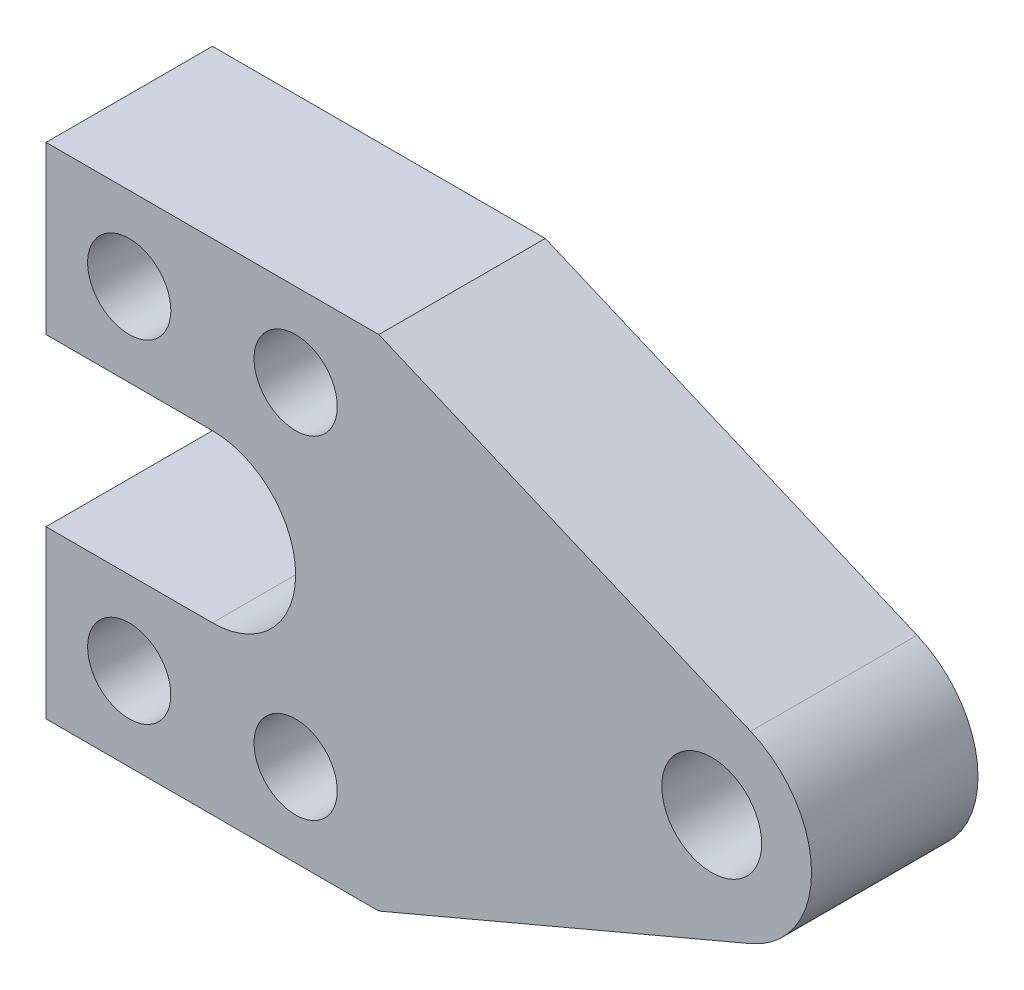
ISO-10303-21;
HEADER;
FILE_DESCRIPTION(('STEP AP214'),'2;1');
FILE_NAME('part.step','',(''),(''),'','','');
FILE_SCHEMA(('AUTOMOTIVE_DESIGN { 1 0 10303 214 1 1 1 1 }'));
ENDSEC;
DATA;
#1=APPLICATION_CONTEXT('core data for automotive mechanical design processes');
#2=APPLICATION_PROTOCOL_DEFINITION('international standard','automotive_design',2000,#1);
#3=PRODUCT_CONTEXT('',#1,'mechanical');
#4=PRODUCT('Part','Part','',(#3));
#5=PRODUCT_RELATED_PRODUCT_CATEGORY('part','',(#4));
#6=PRODUCT_DEFINITION_FORMATION('','',#4);
#7=PRODUCT_DEFINITION_CONTEXT('part definition',#1,'design');
#8=PRODUCT_DEFINITION('design','',#6,#7);
#9=PRODUCT_DEFINITION_SHAPE('','',#8);
#10=(LENGTH_UNIT() NAMED_UNIT(*) SI_UNIT(.MILLI.,.METRE.));
#11=(NAMED_UNIT(*) PLANE_ANGLE_UNIT() SI_UNIT($,.RADIAN.));
#12=(NAMED_UNIT(*) SI_UNIT($,.STERADIAN.) SOLID_ANGLE_UNIT());
#13=UNCERTAINTY_MEASURE_WITH_UNIT(LENGTH_MEASURE(1.E-05),#10,'distance_accuracy_value','');
#14=(GEOMETRIC_REPRESENTATION_CONTEXT(3) GLOBAL_UNCERTAINTY_ASSIGNED_CONTEXT((#13)) GLOBAL_UNIT_ASSIGNED_CONTEXT((#10,
#11,#12)) REPRESENTATION_CONTEXT('',''));
#15=CARTESIAN_POINT('',(0.,0.,0.));
#16=DIRECTION('',(0.,0.,1.));
#17=DIRECTION('',(1.,0.,0.));
#18=AXIS2_PLACEMENT_3D('',#15,#16,#17);
#19=CARTESIAN_POINT('',(80.,0.,20.));
#20=DIRECTION('',(0.,0.,1.));
#21=DIRECTION('',(1.,0.,0.));
#22=AXIS2_PLACEMENT_3D('',#19,#20,#21);
#23=PLANE('',#22);
#24=CARTESIAN_POINT('',(30.,-20.,20.));
#25=DIRECTION('',(0.,0.,1.));
#26=DIRECTION('',(-1.,0.,0.));
#27=AXIS2_PLACEMENT_3D('',#24,#25,#26);
#28=CIRCLE('',#27,4.99999999999999);
#29=CARTESIAN_POINT('',(25.,-20.,20.));
#30=VERTEX_POINT('',#29);
#31=EDGE_CURVE('E224',#30,#30,#28,.T.);
#32=ORIENTED_EDGE('',*,*,#31,.F.);
#33=EDGE_LOOP('',(#32));
#34=FACE_BOUND('',#33,.T.);
#35=CARTESIAN_POINT('',(80.,0.,20.));
#36=DIRECTION('',(0.,0.,1.));
#37=DIRECTION('',(1.,0.,0.));
#38=AXIS2_PLACEMENT_3D('',#35,#36,#37);
#39=CIRCLE('',#38,6.);
#40=CARTESIAN_POINT('',(86.,0.,20.));
#41=VERTEX_POINT('',#40);
#42=EDGE_CURVE('E212',#41,#41,#39,.T.);
#43=ORIENTED_EDGE('',*,*,#42,.F.);
#44=EDGE_LOOP('',(#43));
#45=FACE_BOUND('',#44,.T.);
#46=DIRECTION('',(0.,-1.,0.));
#47=VECTOR('',#46,1.);
#48=CARTESIAN_POINT('',(0.,10.,20.));
#49=LINE('',#48,#47);
#50=CARTESIAN_POINT('',(0.,30.,20.));
#51=VERTEX_POINT('',#50);
#52=CARTESIAN_POINT('',(0.,10.,20.));
#53=VERTEX_POINT('',#52);
#54=EDGE_CURVE('E161',#51,#53,#49,.T.);
#55=ORIENTED_EDGE('',*,*,#54,.T.);
#56=DIRECTION('',(1.,0.,0.));
#57=VECTOR('',#56,1.);
#58=CARTESIAN_POINT('',(0.,10.,20.));
#59=LINE('',#58,#57);
#60=CARTESIAN_POINT('',(20.,10.,20.));
#61=VERTEX_POINT('',#60);
#62=EDGE_CURVE('E99',#53,#61,#59,.T.);
#63=ORIENTED_EDGE('',*,*,#62,.T.);
#64=CARTESIAN_POINT('',(20.,0.,20.));
#65=DIRECTION('',(0.,0.,-1.));
#66=DIRECTION('',(-1.,0.,0.));
#67=AXIS2_PLACEMENT_3D('',#64,#65,#66);
#68=CIRCLE('',#67,10.);
#69=CARTESIAN_POINT('',(20.,-10.,20.));
#70=VERTEX_POINT('',#69);
#71=EDGE_CURVE('E182',#61,#70,#68,.T.);
#72=ORIENTED_EDGE('',*,*,#71,.T.);
#73=DIRECTION('',(-1.,0.,0.));
#74=VECTOR('',#73,1.);
#75=CARTESIAN_POINT('',(0.,-10.,20.));
#76=LINE('',#75,#74);
#77=CARTESIAN_POINT('',(0.,-10.,20.));
#78=VERTEX_POINT('',#77);
#79=EDGE_CURVE('E201',#70,#78,#76,.T.);
#80=ORIENTED_EDGE('',*,*,#79,.T.);
#81=DIRECTION('',(0.,-1.,0.));
#82=VECTOR('',#81,1.);
#83=CARTESIAN_POINT('',(0.,-10.,20.));
#84=LINE('',#83,#82);
#85=CARTESIAN_POINT('',(0.,-30.,20.));
#86=VERTEX_POINT('',#85);
#87=EDGE_CURVE('E198',#78,#86,#84,.T.);
#88=ORIENTED_EDGE('',*,*,#87,.T.);
#89=DIRECTION('',(1.,0.,0.));
#90=VECTOR('',#89,1.);
#91=CARTESIAN_POINT('',(0.,-30.,20.));
#92=LINE('',#91,#90);
#93=CARTESIAN_POINT('',(40.,-30.,20.));
#94=VERTEX_POINT('',#93);
#95=EDGE_CURVE('E200',#86,#94,#92,.T.);
#96=ORIENTED_EDGE('',*,*,#95,.T.);
#97=DIRECTION('',(0.920618310368742,0.390463732776557,0.));
#98=VECTOR('',#97,1.);
#99=CARTESIAN_POINT('',(40.,-30.,20.));
#100=LINE('',#99,#98);
#101=CARTESIAN_POINT('',(84.6855647933186,-11.0474197244249,20.));
#102=VERTEX_POINT('',#101);
#103=EDGE_CURVE('E124',#94,#102,#100,.T.);
#104=ORIENTED_EDGE('',*,*,#103,.T.);
#105=CARTESIAN_POINT('',(80.,0.,20.));
#106=DIRECTION('',(0.,0.,1.));
#107=DIRECTION('',(1.,0.,0.));
#108=AXIS2_PLACEMENT_3D('',#105,#106,#107);
#109=CIRCLE('',#108,12.);
#110=CARTESIAN_POINT('',(84.6855647933187,11.0474197244249,20.));
#111=VERTEX_POINT('',#110);
#112=EDGE_CURVE('E118',#102,#111,#109,.T.);
#113=ORIENTED_EDGE('',*,*,#112,.T.);
#114=DIRECTION('',(-0.920618310368742,0.390463732776557,0.));
#115=VECTOR('',#114,1.);
#116=CARTESIAN_POINT('',(40.,30.,20.));
#117=LINE('',#116,#115);
#118=CARTESIAN_POINT('',(40.,30.,20.));
#119=VERTEX_POINT('',#118);
#120=EDGE_CURVE('E122',#111,#119,#117,.T.);
#121=ORIENTED_EDGE('',*,*,#120,.T.);
#122=DIRECTION('',(-1.,0.,0.));
#123=VECTOR('',#122,1.);
#124=CARTESIAN_POINT('',(0.,30.,20.));
#125=LINE('',#124,#123);
#126=EDGE_CURVE('E50',#119,#51,#125,.T.);
#127=ORIENTED_EDGE('',*,*,#126,.T.);
#128=EDGE_LOOP('',(#55,#63,#72,#80,#88,#96,#104,#113,#121,#127));
#129=FACE_BOUND('',#128,.T.);
#130=CARTESIAN_POINT('',(10.,20.,20.));
#131=DIRECTION('',(0.,0.,1.));
#132=DIRECTION('',(1.,0.,0.));
#133=AXIS2_PLACEMENT_3D('',#130,#131,#132);
#134=CIRCLE('',#133,5.);
#135=CARTESIAN_POINT('',(15.,20.,20.));
#136=VERTEX_POINT('',#135);
#137=EDGE_CURVE('E146',#136,#136,#134,.T.);
#138=ORIENTED_EDGE('',*,*,#137,.F.);
#139=EDGE_LOOP('',(#138));
#140=FACE_BOUND('',#139,.T.);
#141=CARTESIAN_POINT('',(30.,20.,20.));
#142=DIRECTION('',(0.,0.,1.));
#143=DIRECTION('',(1.,0.,0.));
#144=AXIS2_PLACEMENT_3D('',#141,#142,#143);
#145=CIRCLE('',#144,5.);
#146=CARTESIAN_POINT('',(35.,20.,20.));
#147=VERTEX_POINT('',#146);
#148=EDGE_CURVE('E218',#147,#147,#145,.T.);
#149=ORIENTED_EDGE('',*,*,#148,.F.);
#150=EDGE_LOOP('',(#149));
#151=FACE_BOUND('',#150,.T.);
#152=CARTESIAN_POINT('',(9.99999999999999,-20.,20.));
#153=DIRECTION('',(0.,0.,1.));
#154=DIRECTION('',(-1.,0.,0.));
#155=AXIS2_PLACEMENT_3D('',#152,#153,#154);
#156=CIRCLE('',#155,5.);
#157=CARTESIAN_POINT('',(4.99999999999999,-20.,20.));
#158=VERTEX_POINT('',#157);
#159=EDGE_CURVE('E230',#158,#158,#156,.T.);
#160=ORIENTED_EDGE('',*,*,#159,.F.);
#161=EDGE_LOOP('',(#160));
#162=FACE_BOUND('',#161,.T.);
#163=ADVANCED_FACE('F33',(#34,#45,#129,#140,#151,#162),#23,.T.);
#164=CARTESIAN_POINT('',(80.,0.,0.));
#165=DIRECTION('',(0.,0.,1.));
#166=DIRECTION('',(1.,0.,0.));
#167=AXIS2_PLACEMENT_3D('',#164,#165,#166);
#168=PLANE('',#167);
#169=DIRECTION('',(0.,-1.,0.));
#170=VECTOR('',#169,1.);
#171=CARTESIAN_POINT('',(0.,10.,0.));
#172=LINE('',#171,#170);
#173=CARTESIAN_POINT('',(0.,30.,0.));
#174=VERTEX_POINT('',#173);
#175=CARTESIAN_POINT('',(0.,10.,0.));
#176=VERTEX_POINT('',#175);
#177=EDGE_CURVE('E142',#174,#176,#172,.T.);
#178=ORIENTED_EDGE('',*,*,#177,.F.);
#179=DIRECTION('',(-1.,0.,0.));
#180=VECTOR('',#179,1.);
#181=CARTESIAN_POINT('',(0.,30.,0.));
#182=LINE('',#181,#180);
#183=CARTESIAN_POINT('',(40.,30.,0.));
#184=VERTEX_POINT('',#183);
#185=EDGE_CURVE('E91',#184,#174,#182,.T.);
#186=ORIENTED_EDGE('',*,*,#185,.F.);
#187=DIRECTION('',(-0.920618310368742,0.390463732776557,0.));
#188=VECTOR('',#187,1.);
#189=CARTESIAN_POINT('',(40.,30.,0.));
#190=LINE('',#189,#188);
#191=CARTESIAN_POINT('',(84.6855647933187,11.0474197244249,0.));
#192=VERTEX_POINT('',#191);
#193=EDGE_CURVE('E85',#192,#184,#190,.T.);
#194=ORIENTED_EDGE('',*,*,#193,.F.);
#195=CARTESIAN_POINT('',(80.,0.,0.));
#196=DIRECTION('',(0.,0.,1.));
#197=DIRECTION('',(1.,0.,0.));
#198=AXIS2_PLACEMENT_3D('',#195,#196,#197);
#199=CIRCLE('',#198,12.);
#200=CARTESIAN_POINT('',(84.6855647933186,-11.0474197244249,0.));
#201=VERTEX_POINT('',#200);
#202=EDGE_CURVE('E132',#201,#192,#199,.T.);
#203=ORIENTED_EDGE('',*,*,#202,.F.);
#204=DIRECTION('',(0.920618310368742,0.390463732776557,0.));
#205=VECTOR('',#204,1.);
#206=CARTESIAN_POINT('',(40.,-30.,0.));
#207=LINE('',#206,#205);
#208=CARTESIAN_POINT('',(40.,-30.,0.));
#209=VERTEX_POINT('',#208);
#210=EDGE_CURVE('E156',#209,#201,#207,.T.);
#211=ORIENTED_EDGE('',*,*,#210,.F.);
#212=DIRECTION('',(1.,0.,0.));
#213=VECTOR('',#212,1.);
#214=CARTESIAN_POINT('',(0.,-30.,0.));
#215=LINE('',#214,#213);
#216=CARTESIAN_POINT('',(0.,-30.,0.));
#217=VERTEX_POINT('',#216);
#218=EDGE_CURVE('E154',#217,#209,#215,.T.);
#219=ORIENTED_EDGE('',*,*,#218,.F.);
#220=DIRECTION('',(0.,-1.,0.));
#221=VECTOR('',#220,1.);
#222=CARTESIAN_POINT('',(0.,-10.,0.));
#223=LINE('',#222,#221);
#224=CARTESIAN_POINT('',(0.,-10.,0.));
#225=VERTEX_POINT('',#224);
#226=EDGE_CURVE('E152',#225,#217,#223,.T.);
#227=ORIENTED_EDGE('',*,*,#226,.F.);
#228=DIRECTION('',(-1.,0.,0.));
#229=VECTOR('',#228,1.);
#230=CARTESIAN_POINT('',(0.,-10.,0.));
#231=LINE('',#230,#229);
#232=CARTESIAN_POINT('',(20.,-10.,0.));
#233=VERTEX_POINT('',#232);
#234=EDGE_CURVE('E150',#233,#225,#231,.T.);
#235=ORIENTED_EDGE('',*,*,#234,.F.);
#236=CARTESIAN_POINT('',(20.,0.,0.));
#237=DIRECTION('',(0.,0.,-1.));
#238=DIRECTION('',(-1.,0.,0.));
#239=AXIS2_PLACEMENT_3D('',#236,#237,#238);
#240=CIRCLE('',#239,10.);
#241=CARTESIAN_POINT('',(20.,10.,0.));
#242=VERTEX_POINT('',#241);
#243=EDGE_CURVE('E148',#242,#233,#240,.T.);
#244=ORIENTED_EDGE('',*,*,#243,.F.);
#245=DIRECTION('',(1.,0.,0.));
#246=VECTOR('',#245,1.);
#247=CARTESIAN_POINT('',(0.,10.,0.));
#248=LINE('',#247,#246);
#249=EDGE_CURVE('E145',#176,#242,#248,.T.);
#250=ORIENTED_EDGE('',*,*,#249,.F.);
#251=EDGE_LOOP('',(#178,#186,#194,#203,#211,#219,#227,#235,#244,#250));
#252=FACE_BOUND('',#251,.T.);
#253=CARTESIAN_POINT('',(10.,20.,0.));
#254=DIRECTION('',(0.,0.,1.));
#255=DIRECTION('',(1.,0.,0.));
#256=AXIS2_PLACEMENT_3D('',#253,#254,#255);
#257=CIRCLE('',#256,5.);
#258=CARTESIAN_POINT('',(15.,20.,0.));
#259=VERTEX_POINT('',#258);
#260=EDGE_CURVE('E209',#259,#259,#257,.T.);
#261=ORIENTED_EDGE('',*,*,#260,.T.);
#262=EDGE_LOOP('',(#261));
#263=FACE_BOUND('',#262,.T.);
#264=CARTESIAN_POINT('',(80.,0.,0.));
#265=DIRECTION('',(0.,0.,1.));
#266=DIRECTION('',(1.,0.,0.));
#267=AXIS2_PLACEMENT_3D('',#264,#265,#266);
#268=CIRCLE('',#267,6.);
#269=CARTESIAN_POINT('',(86.,0.,0.));
#270=VERTEX_POINT('',#269);
#271=EDGE_CURVE('E215',#270,#270,#268,.T.);
#272=ORIENTED_EDGE('',*,*,#271,.T.);
#273=EDGE_LOOP('',(#272));
#274=FACE_BOUND('',#273,.T.);
#275=CARTESIAN_POINT('',(30.,20.,0.));
#276=DIRECTION('',(0.,0.,1.));
#277=DIRECTION('',(1.,0.,0.));
#278=AXIS2_PLACEMENT_3D('',#275,#276,#277);
#279=CIRCLE('',#278,5.);
#280=CARTESIAN_POINT('',(35.,20.,0.));
#281=VERTEX_POINT('',#280);
#282=EDGE_CURVE('E221',#281,#281,#279,.T.);
#283=ORIENTED_EDGE('',*,*,#282,.T.);
#284=EDGE_LOOP('',(#283));
#285=FACE_BOUND('',#284,.T.);
#286=CARTESIAN_POINT('',(30.,-20.,0.));
#287=DIRECTION('',(0.,0.,1.));
#288=DIRECTION('',(-1.,0.,0.));
#289=AXIS2_PLACEMENT_3D('',#286,#287,#288);
#290=CIRCLE('',#289,4.99999999999999);
#291=CARTESIAN_POINT('',(25.,-20.,0.));
#292=VERTEX_POINT('',#291);
#293=EDGE_CURVE('E227',#292,#292,#290,.T.);
#294=ORIENTED_EDGE('',*,*,#293,.T.);
#295=EDGE_LOOP('',(#294));
#296=FACE_BOUND('',#295,.T.);
#297=CARTESIAN_POINT('',(9.99999999999999,-20.,0.));
#298=DIRECTION('',(0.,0.,1.));
#299=DIRECTION('',(-1.,0.,0.));
#300=AXIS2_PLACEMENT_3D('',#297,#298,#299);
#301=CIRCLE('',#300,5.);
#302=CARTESIAN_POINT('',(4.99999999999999,-20.,0.));
#303=VERTEX_POINT('',#302);
#304=EDGE_CURVE('E233',#303,#303,#301,.T.);
#305=ORIENTED_EDGE('',*,*,#304,.T.);
#306=EDGE_LOOP('',(#305));
#307=FACE_BOUND('',#306,.T.);
#308=ADVANCED_FACE('F186',(#252,#263,#274,#285,#296,#307),#168,.F.);
#309=CARTESIAN_POINT('',(0.,10.,20.));
#310=DIRECTION('',(1.,0.,0.));
#311=DIRECTION('',(0.,0.,-1.));
#312=AXIS2_PLACEMENT_3D('',#309,#310,#311);
#313=PLANE('',#312);
#314=ORIENTED_EDGE('',*,*,#177,.T.);
#315=DIRECTION('',(0.,0.,-1.));
#316=VECTOR('',#315,1.);
#317=CARTESIAN_POINT('',(0.,10.,20.));
#318=LINE('',#317,#316);
#319=EDGE_CURVE('E11',#53,#176,#318,.T.);
#320=ORIENTED_EDGE('',*,*,#319,.F.);
#321=ORIENTED_EDGE('',*,*,#54,.F.);
#322=DIRECTION('',(0.,0.,-1.));
#323=VECTOR('',#322,1.);
#324=CARTESIAN_POINT('',(0.,30.,20.));
#325=LINE('',#324,#323);
#326=EDGE_CURVE('E138',#51,#174,#325,.T.);
#327=ORIENTED_EDGE('',*,*,#326,.T.);
#328=EDGE_LOOP('',(#314,#320,#321,#327));
#329=FACE_BOUND('',#328,.T.);
#330=ADVANCED_FACE('F35',(#329),#313,.F.);
#331=CARTESIAN_POINT('',(0.,10.,20.));
#332=DIRECTION('',(0.,1.,0.));
#333=DIRECTION('',(0.,0.,1.));
#334=AXIS2_PLACEMENT_3D('',#331,#332,#333);
#335=PLANE('',#334);
#336=ORIENTED_EDGE('',*,*,#249,.T.);
#337=DIRECTION('',(0.,0.,-1.));
#338=VECTOR('',#337,1.);
#339=CARTESIAN_POINT('',(20.,10.,20.));
#340=LINE('',#339,#338);
#341=EDGE_CURVE('E42',#61,#242,#340,.T.);
#342=ORIENTED_EDGE('',*,*,#341,.F.);
#343=ORIENTED_EDGE('',*,*,#62,.F.);
#344=ORIENTED_EDGE('',*,*,#319,.T.);
#345=EDGE_LOOP('',(#336,#342,#343,#344));
#346=FACE_BOUND('',#345,.T.);
#347=ADVANCED_FACE('F275',(#346),#335,.F.);
#348=CARTESIAN_POINT('',(20.,0.,20.));
#349=DIRECTION('',(0.,0.,-1.));
#350=DIRECTION('',(-1.,0.,0.));
#351=AXIS2_PLACEMENT_3D('',#348,#349,#350);
#352=CYLINDRICAL_SURFACE('',#351,10.);
#353=ORIENTED_EDGE('',*,*,#243,.T.);
#354=DIRECTION('',(0.,0.,-1.));
#355=VECTOR('',#354,1.);
#356=CARTESIAN_POINT('',(20.,-10.,20.));
#357=LINE('',#356,#355);
#358=EDGE_CURVE('E174',#70,#233,#357,.T.);
#359=ORIENTED_EDGE('',*,*,#358,.F.);
#360=ORIENTED_EDGE('',*,*,#71,.F.);
#361=ORIENTED_EDGE('',*,*,#341,.T.);
#362=EDGE_LOOP('',(#353,#359,#360,#361));
#363=FACE_BOUND('',#362,.T.);
#364=ADVANCED_FACE('F180',(#363),#352,.F.);
#365=CARTESIAN_POINT('',(0.,-10.,20.));
#366=DIRECTION('',(0.,-1.,0.));
#367=DIRECTION('',(0.,0.,-1.));
#368=AXIS2_PLACEMENT_3D('',#365,#366,#367);
#369=PLANE('',#368);
#370=ORIENTED_EDGE('',*,*,#234,.T.);
#371=DIRECTION('',(0.,0.,-1.));
#372=VECTOR('',#371,1.);
#373=CARTESIAN_POINT('',(0.,-10.,20.));
#374=LINE('',#373,#372);
#375=EDGE_CURVE('E171',#78,#225,#374,.T.);
#376=ORIENTED_EDGE('',*,*,#375,.F.);
#377=ORIENTED_EDGE('',*,*,#79,.F.);
#378=ORIENTED_EDGE('',*,*,#358,.T.);
#379=EDGE_LOOP('',(#370,#376,#377,#378));
#380=FACE_BOUND('',#379,.T.);
#381=ADVANCED_FACE('F192',(#380),#369,.F.);
#382=CARTESIAN_POINT('',(0.,-10.,20.));
#383=DIRECTION('',(1.,0.,0.));
#384=DIRECTION('',(0.,0.,-1.));
#385=AXIS2_PLACEMENT_3D('',#382,#383,#384);
#386=PLANE('',#385);
#387=ORIENTED_EDGE('',*,*,#226,.T.);
#388=DIRECTION('',(0.,0.,-1.));
#389=VECTOR('',#388,1.);
#390=CARTESIAN_POINT('',(0.,-30.,20.));
#391=LINE('',#390,#389);
#392=EDGE_CURVE('E168',#86,#217,#391,.T.);
#393=ORIENTED_EDGE('',*,*,#392,.F.);
#394=ORIENTED_EDGE('',*,*,#87,.F.);
#395=ORIENTED_EDGE('',*,*,#375,.T.);
#396=EDGE_LOOP('',(#387,#393,#394,#395));
#397=FACE_BOUND('',#396,.T.);
#398=ADVANCED_FACE('F196',(#397),#386,.F.);
#399=CARTESIAN_POINT('',(0.,-30.,20.));
#400=DIRECTION('',(0.,1.,0.));
#401=DIRECTION('',(0.,0.,1.));
#402=AXIS2_PLACEMENT_3D('',#399,#400,#401);
#403=PLANE('',#402);
#404=ORIENTED_EDGE('',*,*,#218,.T.);
#405=DIRECTION('',(0.,0.,-1.));
#406=VECTOR('',#405,1.);
#407=CARTESIAN_POINT('',(40.,-30.,20.));
#408=LINE('',#407,#406);
#409=EDGE_CURVE('E165',#94,#209,#408,.T.);
#410=ORIENTED_EDGE('',*,*,#409,.F.);
#411=ORIENTED_EDGE('',*,*,#95,.F.);
#412=ORIENTED_EDGE('',*,*,#392,.T.);
#413=EDGE_LOOP('',(#404,#410,#411,#412));
#414=FACE_BOUND('',#413,.T.);
#415=ADVANCED_FACE('F265',(#414),#403,.F.);
#416=CARTESIAN_POINT('',(40.,-30.,20.));
#417=DIRECTION('',(-0.390463732776557,0.920618310368742,0.));
#418=DIRECTION('',(-0.920618310368742,-0.390463732776557,0.));
#419=AXIS2_PLACEMENT_3D('',#416,#417,#418);
#420=PLANE('',#419);
#421=ORIENTED_EDGE('',*,*,#210,.T.);
#422=DIRECTION('',(0.,0.,-1.));
#423=VECTOR('',#422,1.);
#424=CARTESIAN_POINT('',(84.6855647933186,-11.0474197244249,20.));
#425=LINE('',#424,#423);
#426=EDGE_CURVE('E133',#102,#201,#425,.T.);
#427=ORIENTED_EDGE('',*,*,#426,.F.);
#428=ORIENTED_EDGE('',*,*,#103,.F.);
#429=ORIENTED_EDGE('',*,*,#409,.T.);
#430=EDGE_LOOP('',(#421,#427,#428,#429));
#431=FACE_BOUND('',#430,.T.);
#432=ADVANCED_FACE('F262',(#431),#420,.F.);
#433=CARTESIAN_POINT('',(80.,0.,20.));
#434=DIRECTION('',(0.,0.,-1.));
#435=DIRECTION('',(-1.,0.,0.));
#436=AXIS2_PLACEMENT_3D('',#433,#434,#435);
#437=CYLINDRICAL_SURFACE('',#436,12.);
#438=ORIENTED_EDGE('',*,*,#202,.T.);
#439=DIRECTION('',(0.,0.,-1.));
#440=VECTOR('',#439,1.);
#441=CARTESIAN_POINT('',(84.6855647933187,11.0474197244249,20.));
#442=LINE('',#441,#440);
#443=EDGE_CURVE('E129',#111,#192,#442,.T.);
#444=ORIENTED_EDGE('',*,*,#443,.F.);
#445=ORIENTED_EDGE('',*,*,#112,.F.);
#446=ORIENTED_EDGE('',*,*,#426,.T.);
#447=EDGE_LOOP('',(#438,#444,#445,#446));
#448=FACE_BOUND('',#447,.T.);
#449=ADVANCED_FACE('F130',(#448),#437,.T.);
#450=CARTESIAN_POINT('',(40.,30.,20.));
#451=DIRECTION('',(-0.390463732776557,-0.920618310368742,0.));
#452=DIRECTION('',(0.920618310368742,-0.390463732776557,0.));
#453=AXIS2_PLACEMENT_3D('',#450,#451,#452);
#454=PLANE('',#453);
#455=ORIENTED_EDGE('',*,*,#193,.T.);
#456=DIRECTION('',(0.,0.,-1.));
#457=VECTOR('',#456,1.);
#458=CARTESIAN_POINT('',(40.,30.,20.));
#459=LINE('',#458,#457);
#460=EDGE_CURVE('E134',#119,#184,#459,.T.);
#461=ORIENTED_EDGE('',*,*,#460,.F.);
#462=ORIENTED_EDGE('',*,*,#120,.F.);
#463=ORIENTED_EDGE('',*,*,#443,.T.);
#464=EDGE_LOOP('',(#455,#461,#462,#463));
#465=FACE_BOUND('',#464,.T.);
#466=ADVANCED_FACE('F136',(#465),#454,.F.);
#467=CARTESIAN_POINT('',(0.,30.,20.));
#468=DIRECTION('',(0.,-1.,0.));
#469=DIRECTION('',(0.,0.,-1.));
#470=AXIS2_PLACEMENT_3D('',#467,#468,#469);
#471=PLANE('',#470);
#472=ORIENTED_EDGE('',*,*,#185,.T.);
#473=ORIENTED_EDGE('',*,*,#326,.F.);
#474=ORIENTED_EDGE('',*,*,#126,.F.);
#475=ORIENTED_EDGE('',*,*,#460,.T.);
#476=EDGE_LOOP('',(#472,#473,#474,#475));
#477=FACE_BOUND('',#476,.T.);
#478=ADVANCED_FACE('F255',(#477),#471,.F.);
#479=CARTESIAN_POINT('',(10.,20.,20.));
#480=DIRECTION('',(0.,0.,-1.));
#481=DIRECTION('',(-1.,0.,0.));
#482=AXIS2_PLACEMENT_3D('',#479,#480,#481);
#483=CYLINDRICAL_SURFACE('',#482,5.);
#484=ORIENTED_EDGE('',*,*,#137,.T.);
#485=EDGE_LOOP('',(#484));
#486=FACE_BOUND('',#485,.T.);
#487=ORIENTED_EDGE('',*,*,#260,.F.);
#488=EDGE_LOOP('',(#487));
#489=FACE_BOUND('',#488,.T.);
#490=ADVANCED_FACE('F252',(#486,#489),#483,.F.);
#491=CARTESIAN_POINT('',(80.,0.,20.));
#492=DIRECTION('',(0.,0.,-1.));
#493=DIRECTION('',(-1.,0.,0.));
#494=AXIS2_PLACEMENT_3D('',#491,#492,#493);
#495=CYLINDRICAL_SURFACE('',#494,6.);
#496=ORIENTED_EDGE('',*,*,#42,.T.);
#497=EDGE_LOOP('',(#496));
#498=FACE_BOUND('',#497,.T.);
#499=ORIENTED_EDGE('',*,*,#271,.F.);
#500=EDGE_LOOP('',(#499));
#501=FACE_BOUND('',#500,.T.);
#502=ADVANCED_FACE('F351',(#498,#501),#495,.F.);
#503=CARTESIAN_POINT('',(30.,20.,20.));
#504=DIRECTION('',(0.,0.,-1.));
#505=DIRECTION('',(-1.,0.,0.));
#506=AXIS2_PLACEMENT_3D('',#503,#504,#505);
#507=CYLINDRICAL_SURFACE('',#506,5.);
#508=ORIENTED_EDGE('',*,*,#148,.T.);
#509=EDGE_LOOP('',(#508));
#510=FACE_BOUND('',#509,.T.);
#511=ORIENTED_EDGE('',*,*,#282,.F.);
#512=EDGE_LOOP('',(#511));
#513=FACE_BOUND('',#512,.T.);
#514=ADVANCED_FACE('F359',(#510,#513),#507,.F.);
#515=CARTESIAN_POINT('',(30.,-20.,20.));
#516=DIRECTION('',(0.,0.,-1.));
#517=DIRECTION('',(-1.,0.,0.));
#518=AXIS2_PLACEMENT_3D('',#515,#516,#517);
#519=CYLINDRICAL_SURFACE('',#518,4.99999999999999);
#520=ORIENTED_EDGE('',*,*,#31,.T.);
#521=EDGE_LOOP('',(#520));
#522=FACE_BOUND('',#521,.T.);
#523=ORIENTED_EDGE('',*,*,#293,.F.);
#524=EDGE_LOOP('',(#523));
#525=FACE_BOUND('',#524,.T.);
#526=ADVANCED_FACE('F367',(#522,#525),#519,.F.);
#527=CARTESIAN_POINT('',(9.99999999999999,-20.,20.));
#528=DIRECTION('',(0.,0.,-1.));
#529=DIRECTION('',(-1.,0.,0.));
#530=AXIS2_PLACEMENT_3D('',#527,#528,#529);
#531=CYLINDRICAL_SURFACE('',#530,5.);
#532=ORIENTED_EDGE('',*,*,#159,.T.);
#533=EDGE_LOOP('',(#532));
#534=FACE_BOUND('',#533,.T.);
#535=ORIENTED_EDGE('',*,*,#304,.F.);
#536=EDGE_LOOP('',(#535));
#537=FACE_BOUND('',#536,.T.);
#538=ADVANCED_FACE('F239',(#534,#537),#531,.F.);
#539=CLOSED_SHELL('',(#163,#308,#330,#347,#364,#381,#398,#415,#432,#449,#466,#478,#490,#502,
#514,#526,#538));
#540=MANIFOLD_SOLID_BREP('B2',#539);
#541=ADVANCED_BREP_SHAPE_REPRESENTATION('',(#18,#540),#14);
#542=SHAPE_DEFINITION_REPRESENTATION(#9,#541);
ENDSEC;
END-ISO-10303-21;
